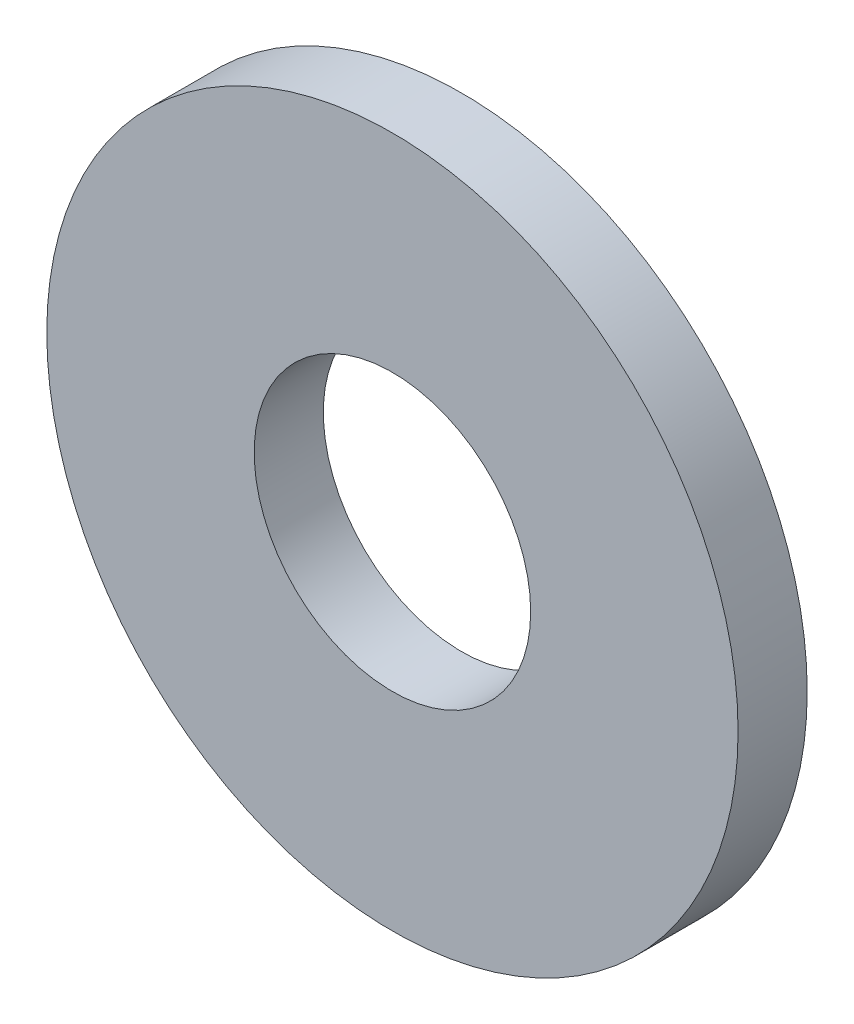
ISO-10303-21;
HEADER;
FILE_DESCRIPTION(('STEP AP214'),'2;1');
FILE_NAME('part.step','',(''),(''),'','','');
FILE_SCHEMA(('AUTOMOTIVE_DESIGN { 1 0 10303 214 1 1 1 1 }'));
ENDSEC;
DATA;
#1=APPLICATION_CONTEXT('core data for automotive mechanical design processes');
#2=APPLICATION_PROTOCOL_DEFINITION('international standard','automotive_design',2000,#1);
#3=PRODUCT_CONTEXT('',#1,'mechanical');
#4=PRODUCT('Part','Part','',(#3));
#5=PRODUCT_RELATED_PRODUCT_CATEGORY('part','',(#4));
#6=PRODUCT_DEFINITION_FORMATION('','',#4);
#7=PRODUCT_DEFINITION_CONTEXT('part definition',#1,'design');
#8=PRODUCT_DEFINITION('design','',#6,#7);
#9=PRODUCT_DEFINITION_SHAPE('','',#8);
#10=(LENGTH_UNIT() NAMED_UNIT(*) SI_UNIT(.MILLI.,.METRE.));
#11=(NAMED_UNIT(*) PLANE_ANGLE_UNIT() SI_UNIT($,.RADIAN.));
#12=(NAMED_UNIT(*) SI_UNIT($,.STERADIAN.) SOLID_ANGLE_UNIT());
#13=UNCERTAINTY_MEASURE_WITH_UNIT(LENGTH_MEASURE(1.E-05),#10,'distance_accuracy_value','');
#14=(GEOMETRIC_REPRESENTATION_CONTEXT(3) GLOBAL_UNCERTAINTY_ASSIGNED_CONTEXT((#13)) GLOBAL_UNIT_ASSIGNED_CONTEXT((#10,
#11,#12)) REPRESENTATION_CONTEXT('',''));
#15=CARTESIAN_POINT('',(0.,0.,0.));
#16=DIRECTION('',(0.,0.,1.));
#17=DIRECTION('',(1.,0.,0.));
#18=AXIS2_PLACEMENT_3D('',#15,#16,#17);
#19=CARTESIAN_POINT('',(0.,0.,1.5875));
#20=DIRECTION('',(0.,0.,1.));
#21=DIRECTION('',(1.,0.,0.));
#22=AXIS2_PLACEMENT_3D('',#19,#20,#21);
#23=PLANE('',#22);
#24=CARTESIAN_POINT('',(0.,0.,1.5875));
#25=DIRECTION('',(0.,0.,1.));
#26=DIRECTION('',(1.,0.,0.));
#27=AXIS2_PLACEMENT_3D('',#24,#25,#26);
#28=CIRCLE('',#27,7.9375);
#29=CARTESIAN_POINT('',(7.9375,0.,1.5875));
#30=VERTEX_POINT('',#29);
#31=EDGE_CURVE('E10',#30,#30,#28,.T.);
#32=ORIENTED_EDGE('',*,*,#31,.T.);
#33=EDGE_LOOP('',(#32));
#34=FACE_BOUND('',#33,.T.);
#35=CARTESIAN_POINT('',(0.,0.,1.5875));
#36=DIRECTION('',(0.,0.,1.));
#37=DIRECTION('',(1.,0.,0.));
#38=AXIS2_PLACEMENT_3D('',#35,#36,#37);
#39=CIRCLE('',#38,3.175);
#40=CARTESIAN_POINT('',(3.175,0.,1.5875));
#41=VERTEX_POINT('',#40);
#42=EDGE_CURVE('E41',#41,#41,#39,.T.);
#43=ORIENTED_EDGE('',*,*,#42,.F.);
#44=EDGE_LOOP('',(#43));
#45=FACE_BOUND('',#44,.T.);
#46=ADVANCED_FACE('F30',(#34,#45),#23,.T.);
#47=CARTESIAN_POINT('',(0.,0.,0.));
#48=DIRECTION('',(0.,0.,1.));
#49=DIRECTION('',(1.,0.,0.));
#50=AXIS2_PLACEMENT_3D('',#47,#48,#49);
#51=PLANE('',#50);
#52=CARTESIAN_POINT('',(0.,0.,0.));
#53=DIRECTION('',(0.,0.,1.));
#54=DIRECTION('',(1.,0.,0.));
#55=AXIS2_PLACEMENT_3D('',#52,#53,#54);
#56=CIRCLE('',#55,7.9375);
#57=CARTESIAN_POINT('',(7.9375,0.,0.));
#58=VERTEX_POINT('',#57);
#59=EDGE_CURVE('E34',#58,#58,#56,.T.);
#60=ORIENTED_EDGE('',*,*,#59,.F.);
#61=EDGE_LOOP('',(#60));
#62=FACE_BOUND('',#61,.T.);
#63=CARTESIAN_POINT('',(0.,0.,0.));
#64=DIRECTION('',(0.,0.,1.));
#65=DIRECTION('',(1.,0.,0.));
#66=AXIS2_PLACEMENT_3D('',#63,#64,#65);
#67=CIRCLE('',#66,3.175);
#68=CARTESIAN_POINT('',(3.175,0.,0.));
#69=VERTEX_POINT('',#68);
#70=EDGE_CURVE('E43',#69,#69,#67,.T.);
#71=ORIENTED_EDGE('',*,*,#70,.T.);
#72=EDGE_LOOP('',(#71));
#73=FACE_BOUND('',#72,.T.);
#74=ADVANCED_FACE('F53',(#62,#73),#51,.F.);
#75=CARTESIAN_POINT('',(0.,0.,1.5875));
#76=DIRECTION('',(0.,0.,-1.));
#77=DIRECTION('',(-1.,0.,0.));
#78=AXIS2_PLACEMENT_3D('',#75,#76,#77);
#79=CYLINDRICAL_SURFACE('',#78,7.9375);
#80=ORIENTED_EDGE('',*,*,#31,.F.);
#81=EDGE_LOOP('',(#80));
#82=FACE_BOUND('',#81,.T.);
#83=ORIENTED_EDGE('',*,*,#59,.T.);
#84=EDGE_LOOP('',(#83));
#85=FACE_BOUND('',#84,.T.);
#86=ADVANCED_FACE('F32',(#82,#85),#79,.T.);
#87=CARTESIAN_POINT('',(0.,0.,1.5875));
#88=DIRECTION('',(0.,0.,-1.));
#89=DIRECTION('',(-1.,0.,0.));
#90=AXIS2_PLACEMENT_3D('',#87,#88,#89);
#91=CYLINDRICAL_SURFACE('',#90,3.175);
#92=ORIENTED_EDGE('',*,*,#42,.T.);
#93=EDGE_LOOP('',(#92));
#94=FACE_BOUND('',#93,.T.);
#95=ORIENTED_EDGE('',*,*,#70,.F.);
#96=EDGE_LOOP('',(#95));
#97=FACE_BOUND('',#96,.T.);
#98=ADVANCED_FACE('F49',(#94,#97),#91,.F.);
#99=CLOSED_SHELL('',(#46,#74,#86,#98));
#100=MANIFOLD_SOLID_BREP('B2',#99);
#101=ADVANCED_BREP_SHAPE_REPRESENTATION('',(#18,#100),#14);
#102=SHAPE_DEFINITION_REPRESENTATION(#9,#101);
ENDSEC;
END-ISO-10303-21;
